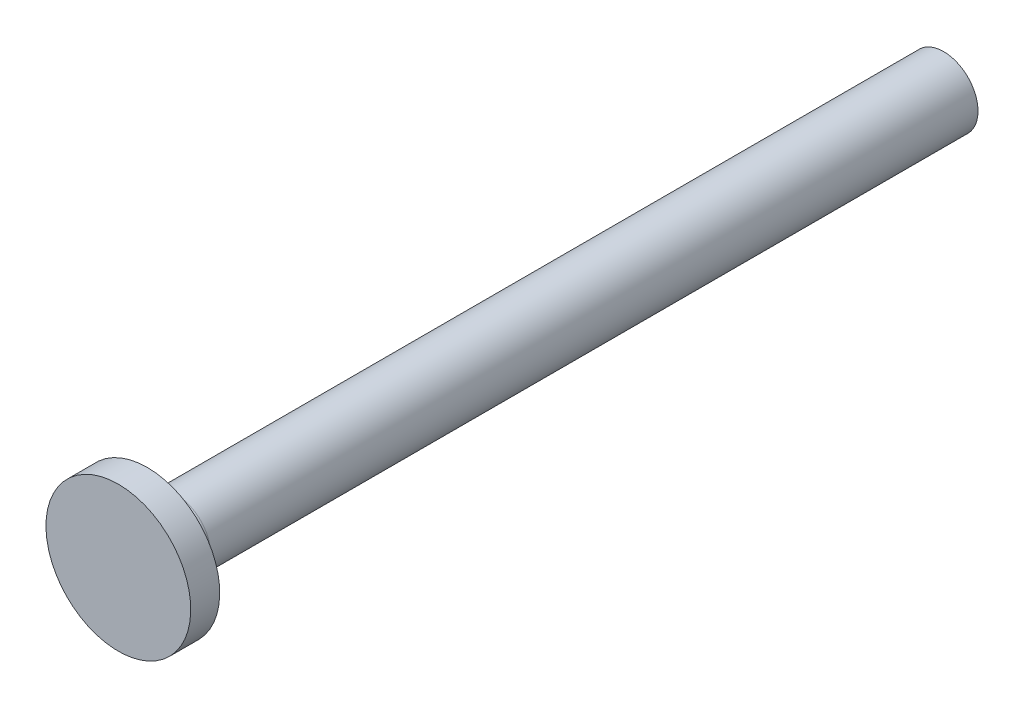
ISO-10303-21;
HEADER;
FILE_DESCRIPTION(('STEP AP214'),'2;1');
FILE_NAME('part.step','',(''),(''),'','','');
FILE_SCHEMA(('AUTOMOTIVE_DESIGN { 1 0 10303 214 1 1 1 1 }'));
ENDSEC;
DATA;
#1=APPLICATION_CONTEXT('core data for automotive mechanical design processes');
#2=APPLICATION_PROTOCOL_DEFINITION('international standard','automotive_design',2000,#1);
#3=PRODUCT_CONTEXT('',#1,'mechanical');
#4=PRODUCT('Part','Part','',(#3));
#5=PRODUCT_RELATED_PRODUCT_CATEGORY('part','',(#4));
#6=PRODUCT_DEFINITION_FORMATION('','',#4);
#7=PRODUCT_DEFINITION_CONTEXT('part definition',#1,'design');
#8=PRODUCT_DEFINITION('design','',#6,#7);
#9=PRODUCT_DEFINITION_SHAPE('','',#8);
#10=(LENGTH_UNIT() NAMED_UNIT(*) SI_UNIT(.MILLI.,.METRE.));
#11=(NAMED_UNIT(*) PLANE_ANGLE_UNIT() SI_UNIT($,.RADIAN.));
#12=(NAMED_UNIT(*) SI_UNIT($,.STERADIAN.) SOLID_ANGLE_UNIT());
#13=UNCERTAINTY_MEASURE_WITH_UNIT(LENGTH_MEASURE(1.E-05),#10,'distance_accuracy_value','');
#14=(GEOMETRIC_REPRESENTATION_CONTEXT(3) GLOBAL_UNCERTAINTY_ASSIGNED_CONTEXT((#13)) GLOBAL_UNIT_ASSIGNED_CONTEXT((#10,
#11,#12)) REPRESENTATION_CONTEXT('',''));
#15=CARTESIAN_POINT('',(0.,0.,0.));
#16=DIRECTION('',(0.,0.,1.));
#17=DIRECTION('',(1.,0.,0.));
#18=AXIS2_PLACEMENT_3D('',#15,#16,#17);
#19=CARTESIAN_POINT('',(0.,0.,-55.));
#20=DIRECTION('',(0.,0.,-1.));
#21=DIRECTION('',(0.,1.,0.));
#22=AXIS2_PLACEMENT_3D('',#19,#20,#21);
#23=CYLINDRICAL_SURFACE('',#22,2.375);
#24=CARTESIAN_POINT('',(0.,0.,-55.));
#25=DIRECTION('',(0.,0.,-1.));
#26=DIRECTION('',(0.,1.,0.));
#27=AXIS2_PLACEMENT_3D('',#24,#25,#26);
#28=CIRCLE('',#27,2.37499999999999);
#29=CARTESIAN_POINT('',(0.,2.37499999999999,-55.));
#30=VERTEX_POINT('',#29);
#31=EDGE_CURVE('E62',#30,#30,#28,.T.);
#32=ORIENTED_EDGE('',*,*,#31,.F.);
#33=EDGE_LOOP('',(#32));
#34=FACE_BOUND('',#33,.T.);
#35=CARTESIAN_POINT('',(0.,0.,-2.));
#36=DIRECTION('',(0.,0.,1.));
#37=DIRECTION('',(1.,0.,0.));
#38=AXIS2_PLACEMENT_3D('',#35,#36,#37);
#39=CIRCLE('',#38,2.375);
#40=CARTESIAN_POINT('',(2.375,0.,-2.));
#41=VERTEX_POINT('',#40);
#42=EDGE_CURVE('E10',#41,#41,#39,.T.);
#43=ORIENTED_EDGE('',*,*,#42,.F.);
#44=EDGE_LOOP('',(#43));
#45=FACE_BOUND('',#44,.T.);
#46=ADVANCED_FACE('F39',(#34,#45),#23,.T.);
#47=CARTESIAN_POINT('',(0.,0.,2.));
#48=DIRECTION('',(0.,0.,-1.));
#49=DIRECTION('',(0.,1.,0.));
#50=AXIS2_PLACEMENT_3D('',#47,#48,#49);
#51=PLANE('',#50);
#52=CARTESIAN_POINT('',(0.,0.,2.));
#53=DIRECTION('',(0.,0.,-1.));
#54=DIRECTION('',(0.,1.,0.));
#55=AXIS2_PLACEMENT_3D('',#52,#53,#54);
#56=CIRCLE('',#55,5.);
#57=CARTESIAN_POINT('',(0.,5.,2.));
#58=VERTEX_POINT('',#57);
#59=EDGE_CURVE('E47',#58,#58,#56,.T.);
#60=ORIENTED_EDGE('',*,*,#59,.F.);
#61=EDGE_LOOP('',(#60));
#62=FACE_BOUND('',#61,.T.);
#63=ADVANCED_FACE('F41',(#62),#51,.F.);
#64=CARTESIAN_POINT('',(0.,0.,-55.));
#65=DIRECTION('',(0.,0.,-1.));
#66=DIRECTION('',(0.,1.,0.));
#67=AXIS2_PLACEMENT_3D('',#64,#65,#66);
#68=CYLINDRICAL_SURFACE('',#67,5.);
#69=CARTESIAN_POINT('',(0.,0.,0.));
#70=DIRECTION('',(0.,0.,-1.));
#71=DIRECTION('',(0.,1.,0.));
#72=AXIS2_PLACEMENT_3D('',#69,#70,#71);
#73=CIRCLE('',#72,5.);
#74=CARTESIAN_POINT('',(0.,5.,0.));
#75=VERTEX_POINT('',#74);
#76=EDGE_CURVE('E53',#75,#75,#73,.T.);
#77=ORIENTED_EDGE('',*,*,#76,.F.);
#78=EDGE_LOOP('',(#77));
#79=FACE_BOUND('',#78,.T.);
#80=ORIENTED_EDGE('',*,*,#59,.T.);
#81=EDGE_LOOP('',(#80));
#82=FACE_BOUND('',#81,.T.);
#83=ADVANCED_FACE('F77',(#79,#82),#68,.T.);
#84=CARTESIAN_POINT('',(0.,-5.,0.));
#85=DIRECTION('',(0.,0.,1.));
#86=DIRECTION('',(0.,-1.,0.));
#87=AXIS2_PLACEMENT_3D('',#84,#85,#86);
#88=PLANE('',#87);
#89=CARTESIAN_POINT('',(0.,0.,0.));
#90=DIRECTION('',(0.,0.,-1.));
#91=DIRECTION('',(0.,1.,0.));
#92=AXIS2_PLACEMENT_3D('',#89,#90,#91);
#93=CIRCLE('',#92,2.375);
#94=CARTESIAN_POINT('',(0.,2.375,0.));
#95=VERTEX_POINT('',#94);
#96=EDGE_CURVE('E57',#95,#95,#93,.T.);
#97=ORIENTED_EDGE('',*,*,#96,.F.);
#98=EDGE_LOOP('',(#97));
#99=FACE_BOUND('',#98,.T.);
#100=ORIENTED_EDGE('',*,*,#76,.T.);
#101=EDGE_LOOP('',(#100));
#102=FACE_BOUND('',#101,.T.);
#103=ADVANCED_FACE('F81',(#99,#102),#88,.F.);
#104=ORIENTED_EDGE('',*,*,#42,.T.);
#105=EDGE_LOOP('',(#104));
#106=FACE_BOUND('',#105,.T.);
#107=ORIENTED_EDGE('',*,*,#96,.T.);
#108=EDGE_LOOP('',(#107));
#109=FACE_BOUND('',#108,.T.);
#110=ADVANCED_FACE('F71',(#106,#109),#23,.T.);
#111=CARTESIAN_POINT('',(0.,-2.37499999999999,-55.));
#112=DIRECTION('',(0.,0.,1.));
#113=DIRECTION('',(0.,-1.,0.));
#114=AXIS2_PLACEMENT_3D('',#111,#112,#113);
#115=PLANE('',#114);
#116=ORIENTED_EDGE('',*,*,#31,.T.);
#117=EDGE_LOOP('',(#116));
#118=FACE_BOUND('',#117,.T.);
#119=ADVANCED_FACE('F66',(#118),#115,.F.);
#120=CLOSED_SHELL('',(#46,#63,#83,#103,#110,#119));
#121=MANIFOLD_SOLID_BREP('B2',#120);
#122=ADVANCED_BREP_SHAPE_REPRESENTATION('',(#18,#121),#14);
#123=SHAPE_DEFINITION_REPRESENTATION(#9,#122);
ENDSEC;
END-ISO-10303-21;
